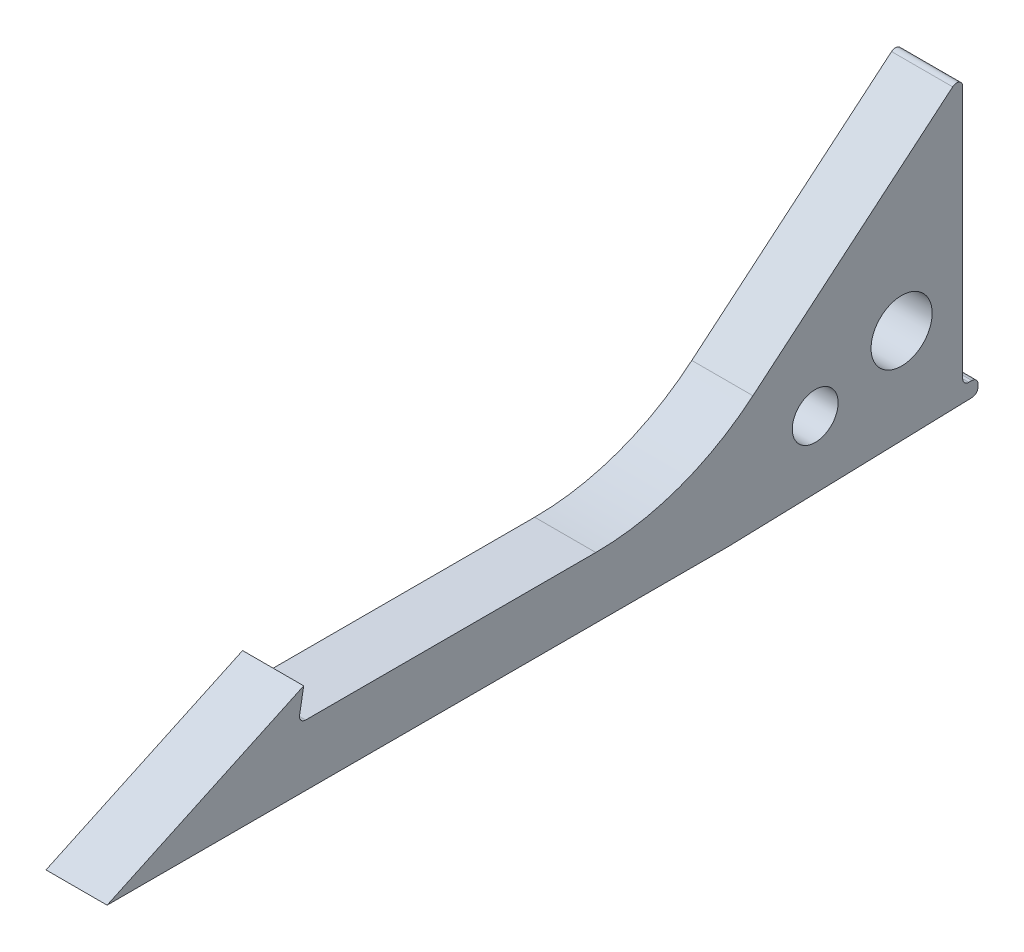
ISO-10303-21;
HEADER;
FILE_DESCRIPTION(('STEP AP214'),'2;1');
FILE_NAME('part.step','',(''),(''),'','','');
FILE_SCHEMA(('AUTOMOTIVE_DESIGN { 1 0 10303 214 1 1 1 1 }'));
ENDSEC;
DATA;
#1=APPLICATION_CONTEXT('core data for automotive mechanical design processes');
#2=APPLICATION_PROTOCOL_DEFINITION('international standard','automotive_design',2000,#1);
#3=PRODUCT_CONTEXT('',#1,'mechanical');
#4=PRODUCT('Part','Part','',(#3));
#5=PRODUCT_RELATED_PRODUCT_CATEGORY('part','',(#4));
#6=PRODUCT_DEFINITION_FORMATION('','',#4);
#7=PRODUCT_DEFINITION_CONTEXT('part definition',#1,'design');
#8=PRODUCT_DEFINITION('design','',#6,#7);
#9=PRODUCT_DEFINITION_SHAPE('','',#8);
#10=(LENGTH_UNIT() NAMED_UNIT(*) SI_UNIT(.MILLI.,.METRE.));
#11=(NAMED_UNIT(*) PLANE_ANGLE_UNIT() SI_UNIT($,.RADIAN.));
#12=(NAMED_UNIT(*) SI_UNIT($,.STERADIAN.) SOLID_ANGLE_UNIT());
#13=UNCERTAINTY_MEASURE_WITH_UNIT(LENGTH_MEASURE(1.E-05),#10,'distance_accuracy_value','');
#14=(GEOMETRIC_REPRESENTATION_CONTEXT(3) GLOBAL_UNCERTAINTY_ASSIGNED_CONTEXT((#13)) GLOBAL_UNIT_ASSIGNED_CONTEXT((#10,
#11,#12)) REPRESENTATION_CONTEXT('',''));
#15=CARTESIAN_POINT('',(0.,0.,0.));
#16=DIRECTION('',(0.,0.,1.));
#17=DIRECTION('',(1.,0.,0.));
#18=AXIS2_PLACEMENT_3D('',#15,#16,#17);
#19=CARTESIAN_POINT('',(41.275,0.,0.));
#20=DIRECTION('',(-1.,0.,0.));
#21=DIRECTION('',(0.,0.,1.));
#22=AXIS2_PLACEMENT_3D('',#19,#20,#21);
#23=PLANE('',#22);
#24=DIRECTION('',(0.,0.,-1.));
#25=VECTOR('',#24,1.);
#26=CARTESIAN_POINT('',(41.275,0.,128.82372));
#27=LINE('',#26,#25);
#28=CARTESIAN_POINT('',(41.275,0.,128.82372));
#29=VERTEX_POINT('',#28);
#30=CARTESIAN_POINT('',(41.275,0.,64.5726085720845));
#31=VERTEX_POINT('',#30);
#32=EDGE_CURVE('E152',#29,#31,#27,.T.);
#33=ORIENTED_EDGE('',*,*,#32,.T.);
#34=CARTESIAN_POINT('',(41.275,25.4,64.5726085720845));
#35=DIRECTION('',(-1.,0.,0.));
#36=DIRECTION('',(0.,0.,1.));
#37=AXIS2_PLACEMENT_3D('',#34,#35,#36);
#38=CIRCLE('',#37,25.4);
#39=CARTESIAN_POINT('',(41.275,0.0110178636845057,63.8245537065478));
#40=VERTEX_POINT('',#39);
#41=EDGE_CURVE('E237',#31,#40,#38,.F.);
#42=ORIENTED_EDGE('',*,*,#41,.T.);
#43=DIRECTION('',(0.,0.029450978958138,-0.999566225839192));
#44=VECTOR('',#43,1.);
#45=CARTESIAN_POINT('',(41.275,0.,64.1985000000002));
#46=LINE('',#45,#44);
#47=CARTESIAN_POINT('',(41.275,0.743841525387115,38.9525186283616));
#48=VERTEX_POINT('',#47);
#49=EDGE_CURVE('E162',#40,#48,#46,.T.);
#50=ORIENTED_EDGE('',*,*,#49,.T.);
#51=CARTESIAN_POINT('',(41.275,1.378566078795,38.97122));
#52=DIRECTION('',(-1.,0.,0.));
#53=DIRECTION('',(0.,0.,1.));
#54=AXIS2_PLACEMENT_3D('',#51,#52,#53);
#55=CIRCLE('',#54,0.635);
#56=CARTESIAN_POINT('',(41.275,1.378566078795,38.33622));
#57=VERTEX_POINT('',#56);
#58=EDGE_CURVE('E201',#48,#57,#55,.F.);
#59=ORIENTED_EDGE('',*,*,#58,.T.);
#60=DIRECTION('',(0.,1.,0.));
#61=VECTOR('',#60,1.);
#62=CARTESIAN_POINT('',(41.275,0.762000000000008,38.33622));
#63=LINE('',#62,#61);
#64=CARTESIAN_POINT('',(41.275,1.65100000000001,38.33622));
#65=VERTEX_POINT('',#64);
#66=EDGE_CURVE('E294',#57,#65,#63,.T.);
#67=ORIENTED_EDGE('',*,*,#66,.T.);
#68=CARTESIAN_POINT('',(41.275,1.65100000000001,38.97122));
#69=DIRECTION('',(-1.,0.,0.));
#70=DIRECTION('',(0.,0.,1.));
#71=AXIS2_PLACEMENT_3D('',#68,#69,#70);
#72=CIRCLE('',#71,0.635);
#73=CARTESIAN_POINT('',(41.275,2.28600000000001,38.97122));
#74=VERTEX_POINT('',#73);
#75=EDGE_CURVE('E199',#65,#74,#72,.F.);
#76=ORIENTED_EDGE('',*,*,#75,.T.);
#77=DIRECTION('',(0.,0.,1.));
#78=VECTOR('',#77,1.);
#79=CARTESIAN_POINT('',(41.275,2.28600000000001,38.33622));
#80=LINE('',#79,#78);
#81=CARTESIAN_POINT('',(41.275,2.28600000000001,39.28872));
#82=VERTEX_POINT('',#81);
#83=EDGE_CURVE('E297',#74,#82,#80,.T.);
#84=ORIENTED_EDGE('',*,*,#83,.T.);
#85=CARTESIAN_POINT('',(41.275,2.92100000000001,39.28872));
#86=DIRECTION('',(-1.,0.,0.));
#87=DIRECTION('',(0.,0.,1.));
#88=AXIS2_PLACEMENT_3D('',#85,#86,#87);
#89=CIRCLE('',#88,0.635);
#90=CARTESIAN_POINT('',(41.275,2.92100000000001,39.92372));
#91=VERTEX_POINT('',#90);
#92=EDGE_CURVE('E229',#82,#91,#89,.T.);
#93=ORIENTED_EDGE('',*,*,#92,.T.);
#94=DIRECTION('',(0.,1.,0.));
#95=VECTOR('',#94,1.);
#96=CARTESIAN_POINT('',(41.275,2.28600000000001,39.92372));
#97=LINE('',#96,#95);
#98=CARTESIAN_POINT('',(41.275,29.2220821357437,39.92372));
#99=VERTEX_POINT('',#98);
#100=EDGE_CURVE('E264',#91,#99,#97,.T.);
#101=ORIENTED_EDGE('',*,*,#100,.T.);
#102=CARTESIAN_POINT('',(41.275,29.2220821357437,40.55872));
#103=DIRECTION('',(-1.,0.,0.));
#104=DIRECTION('',(0.,0.,1.));
#105=AXIS2_PLACEMENT_3D('',#102,#103,#104);
#106=CIRCLE('',#105,0.635);
#107=CARTESIAN_POINT('',(41.275,29.7085203571243,40.9668901321509));
#108=VERTEX_POINT('',#107);
#109=EDGE_CURVE('E197',#99,#108,#106,.F.);
#110=ORIENTED_EDGE('',*,*,#109,.T.);
#111=DIRECTION('',(0.,-0.642787609686539,0.766044443118978));
#112=VECTOR('',#111,1.);
#113=CARTESIAN_POINT('',(41.275,30.5838440302673,39.92372));
#114=LINE('',#113,#112);
#115=CARTESIAN_POINT('',(41.275,12.2924711447779,61.7225293497622));
#116=VERTEX_POINT('',#115);
#117=EDGE_CURVE('E261',#108,#116,#114,.T.);
#118=ORIENTED_EDGE('',*,*,#117,.T.);
#119=CARTESIAN_POINT('',(41.275,31.75,78.0493346358003));
#120=DIRECTION('',(-1.,0.,0.));
#121=DIRECTION('',(0.,0.,1.));
#122=AXIS2_PLACEMENT_3D('',#119,#120,#121);
#123=CIRCLE('',#122,25.4);
#124=CARTESIAN_POINT('',(41.275,6.34999999999998,78.0493346358003));
#125=VERTEX_POINT('',#124);
#126=EDGE_CURVE('E11',#116,#125,#123,.T.);
#127=ORIENTED_EDGE('',*,*,#126,.T.);
#128=DIRECTION('',(0.,0.,1.));
#129=VECTOR('',#128,1.);
#130=CARTESIAN_POINT('',(41.275,6.34999999999998,68.8044906854388));
#131=LINE('',#130,#129);
#132=CARTESIAN_POINT('',(41.275,6.34999999999998,108.200366214598));
#133=VERTEX_POINT('',#132);
#134=EDGE_CURVE('E258',#125,#133,#131,.T.);
#135=ORIENTED_EDGE('',*,*,#134,.T.);
#136=CARTESIAN_POINT('',(41.275,6.98499999999998,108.200366214598));
#137=DIRECTION('',(-1.,0.,0.));
#138=DIRECTION('',(0.,0.,1.));
#139=AXIS2_PLACEMENT_3D('',#136,#137,#138);
#140=CIRCLE('',#139,0.635);
#141=CARTESIAN_POINT('',(41.275,7.09526659281849,108.825719137761));
#142=VERTEX_POINT('',#141);
#143=EDGE_CURVE('E225',#133,#142,#140,.T.);
#144=ORIENTED_EDGE('',*,*,#143,.T.);
#145=DIRECTION('',(0.,0.984807753012207,-0.173648177666936));
#146=VECTOR('',#145,1.);
#147=CARTESIAN_POINT('',(41.275,6.34999999999998,108.957129745895));
#148=LINE('',#147,#146);
#149=CARTESIAN_POINT('',(41.275,9.52499999999998,108.397291582146));
#150=VERTEX_POINT('',#149);
#151=EDGE_CURVE('E168',#142,#150,#148,.T.);
#152=ORIENTED_EDGE('',*,*,#151,.T.);
#153=DIRECTION('',(0.,-0.422618261740694,0.906307787036653));
#154=VECTOR('',#153,1.);
#155=CARTESIAN_POINT('',(41.275,9.52499999999998,108.397291582146));
#156=LINE('',#155,#154);
#157=EDGE_CURVE('E163',#150,#29,#156,.T.);
#158=ORIENTED_EDGE('',*,*,#157,.T.);
#159=EDGE_LOOP('',(#33,#42,#50,#59,#67,#76,#84,#93,#101,#110,#118,#127,#135,#144,#152,#158));
#160=FACE_BOUND('',#159,.T.);
#161=CARTESIAN_POINT('',(41.275,10.414,46.27372));
#162=DIRECTION('',(1.,0.,0.));
#163=DIRECTION('',(0.,0.,-1.));
#164=AXIS2_PLACEMENT_3D('',#161,#162,#163);
#165=CIRCLE('',#164,3.175);
#166=CARTESIAN_POINT('',(41.275,10.414,43.09872));
#167=VERTEX_POINT('',#166);
#168=EDGE_CURVE('E270',#167,#167,#165,.T.);
#169=ORIENTED_EDGE('',*,*,#168,.F.);
#170=EDGE_LOOP('',(#169));
#171=FACE_BOUND('',#170,.T.);
#172=CARTESIAN_POINT('',(41.275,7.23337589676642,55.2519857186079));
#173=DIRECTION('',(1.,0.,0.));
#174=DIRECTION('',(0.,0.,-1.));
#175=AXIS2_PLACEMENT_3D('',#172,#173,#174);
#176=CIRCLE('',#175,2.38125);
#177=CARTESIAN_POINT('',(41.275,7.23337589676642,52.8707357186079));
#178=VERTEX_POINT('',#177);
#179=EDGE_CURVE('E542',#178,#178,#176,.T.);
#180=ORIENTED_EDGE('',*,*,#179,.F.);
#181=EDGE_LOOP('',(#180));
#182=FACE_BOUND('',#181,.T.);
#183=ADVANCED_FACE('F39',(#160,#171,#182),#23,.F.);
#184=CARTESIAN_POINT('',(34.925,0.,0.));
#185=DIRECTION('',(-1.,0.,0.));
#186=DIRECTION('',(0.,0.,1.));
#187=AXIS2_PLACEMENT_3D('',#184,#185,#186);
#188=PLANE('',#187);
#189=CARTESIAN_POINT('',(34.925,10.414,46.27372));
#190=DIRECTION('',(1.,0.,0.));
#191=DIRECTION('',(0.,0.,-1.));
#192=AXIS2_PLACEMENT_3D('',#189,#190,#191);
#193=CIRCLE('',#192,3.175);
#194=CARTESIAN_POINT('',(34.925,10.414,43.09872));
#195=VERTEX_POINT('',#194);
#196=EDGE_CURVE('E541',#195,#195,#193,.T.);
#197=ORIENTED_EDGE('',*,*,#196,.T.);
#198=EDGE_LOOP('',(#197));
#199=FACE_BOUND('',#198,.T.);
#200=DIRECTION('',(0.,0.029450978958138,-0.999566225839192));
#201=VECTOR('',#200,1.);
#202=CARTESIAN_POINT('',(34.925,0.,64.1985000000002));
#203=LINE('',#202,#201);
#204=CARTESIAN_POINT('',(34.925,0.0110178636845057,63.8245537065478));
#205=VERTEX_POINT('',#204);
#206=CARTESIAN_POINT('',(34.925,0.743841525387115,38.9525186283616));
#207=VERTEX_POINT('',#206);
#208=EDGE_CURVE('E272',#205,#207,#203,.T.);
#209=ORIENTED_EDGE('',*,*,#208,.F.);
#210=CARTESIAN_POINT('',(34.925,25.4,64.5726085720845));
#211=DIRECTION('',(-1.,0.,0.));
#212=DIRECTION('',(0.,0.,1.));
#213=AXIS2_PLACEMENT_3D('',#210,#211,#212);
#214=CIRCLE('',#213,25.4);
#215=CARTESIAN_POINT('',(34.925,0.,64.5726085720845));
#216=VERTEX_POINT('',#215);
#217=EDGE_CURVE('E234',#205,#216,#214,.T.);
#218=ORIENTED_EDGE('',*,*,#217,.T.);
#219=DIRECTION('',(0.,0.,-1.));
#220=VECTOR('',#219,1.);
#221=CARTESIAN_POINT('',(34.925,0.,128.82372));
#222=LINE('',#221,#220);
#223=CARTESIAN_POINT('',(34.925,0.,128.82372));
#224=VERTEX_POINT('',#223);
#225=EDGE_CURVE('E269',#224,#216,#222,.T.);
#226=ORIENTED_EDGE('',*,*,#225,.F.);
#227=DIRECTION('',(0.,-0.422618261740694,0.906307787036653));
#228=VECTOR('',#227,1.);
#229=CARTESIAN_POINT('',(34.925,9.52499999999998,108.397291582146));
#230=LINE('',#229,#228);
#231=CARTESIAN_POINT('',(34.925,9.52499999999998,108.397291582146));
#232=VERTEX_POINT('',#231);
#233=EDGE_CURVE('E176',#232,#224,#230,.T.);
#234=ORIENTED_EDGE('',*,*,#233,.F.);
#235=DIRECTION('',(0.,0.984807753012207,-0.173648177666936));
#236=VECTOR('',#235,1.);
#237=CARTESIAN_POINT('',(34.925,6.34999999999998,108.957129745895));
#238=LINE('',#237,#236);
#239=CARTESIAN_POINT('',(34.925,7.09526659281849,108.825719137761));
#240=VERTEX_POINT('',#239);
#241=EDGE_CURVE('E172',#240,#232,#238,.T.);
#242=ORIENTED_EDGE('',*,*,#241,.F.);
#243=CARTESIAN_POINT('',(34.925,6.98499999999998,108.200366214598));
#244=DIRECTION('',(-1.,0.,0.));
#245=DIRECTION('',(0.,0.,1.));
#246=AXIS2_PLACEMENT_3D('',#243,#244,#245);
#247=CIRCLE('',#246,0.635);
#248=CARTESIAN_POINT('',(34.925,6.34999999999998,108.200366214598));
#249=VERTEX_POINT('',#248);
#250=EDGE_CURVE('E222',#240,#249,#247,.F.);
#251=ORIENTED_EDGE('',*,*,#250,.T.);
#252=DIRECTION('',(0.,0.,1.));
#253=VECTOR('',#252,1.);
#254=CARTESIAN_POINT('',(34.925,6.34999999999998,68.8044906854388));
#255=LINE('',#254,#253);
#256=CARTESIAN_POINT('',(34.925,6.34999999999998,78.0493346358003));
#257=VERTEX_POINT('',#256);
#258=EDGE_CURVE('E249',#257,#249,#255,.T.);
#259=ORIENTED_EDGE('',*,*,#258,.F.);
#260=CARTESIAN_POINT('',(34.925,31.75,78.0493346358003));
#261=DIRECTION('',(-1.,0.,0.));
#262=DIRECTION('',(0.,0.,1.));
#263=AXIS2_PLACEMENT_3D('',#260,#261,#262);
#264=CIRCLE('',#263,25.4);
#265=CARTESIAN_POINT('',(34.925,12.2924711447779,61.7225293497622));
#266=VERTEX_POINT('',#265);
#267=EDGE_CURVE('E47',#257,#266,#264,.F.);
#268=ORIENTED_EDGE('',*,*,#267,.T.);
#269=DIRECTION('',(0.,-0.642787609686539,0.766044443118978));
#270=VECTOR('',#269,1.);
#271=CARTESIAN_POINT('',(34.925,30.5838440302673,39.92372));
#272=LINE('',#271,#270);
#273=CARTESIAN_POINT('',(34.925,29.7085203571243,40.9668901321509));
#274=VERTEX_POINT('',#273);
#275=EDGE_CURVE('E248',#274,#266,#272,.T.);
#276=ORIENTED_EDGE('',*,*,#275,.F.);
#277=CARTESIAN_POINT('',(34.925,29.2220821357437,40.55872));
#278=DIRECTION('',(-1.,0.,0.));
#279=DIRECTION('',(0.,0.,1.));
#280=AXIS2_PLACEMENT_3D('',#277,#278,#279);
#281=CIRCLE('',#280,0.635);
#282=CARTESIAN_POINT('',(34.925,29.2220821357437,39.92372));
#283=VERTEX_POINT('',#282);
#284=EDGE_CURVE('E187',#274,#283,#281,.T.);
#285=ORIENTED_EDGE('',*,*,#284,.T.);
#286=DIRECTION('',(0.,1.,0.));
#287=VECTOR('',#286,1.);
#288=CARTESIAN_POINT('',(34.925,2.28600000000001,39.92372));
#289=LINE('',#288,#287);
#290=CARTESIAN_POINT('',(34.925,2.92100000000001,39.92372));
#291=VERTEX_POINT('',#290);
#292=EDGE_CURVE('E254',#291,#283,#289,.T.);
#293=ORIENTED_EDGE('',*,*,#292,.F.);
#294=CARTESIAN_POINT('',(34.925,2.92100000000001,39.28872));
#295=DIRECTION('',(-1.,0.,0.));
#296=DIRECTION('',(0.,0.,1.));
#297=AXIS2_PLACEMENT_3D('',#294,#295,#296);
#298=CIRCLE('',#297,0.635);
#299=CARTESIAN_POINT('',(34.925,2.28600000000001,39.28872));
#300=VERTEX_POINT('',#299);
#301=EDGE_CURVE('E227',#291,#300,#298,.F.);
#302=ORIENTED_EDGE('',*,*,#301,.T.);
#303=DIRECTION('',(0.,0.,1.));
#304=VECTOR('',#303,1.);
#305=CARTESIAN_POINT('',(34.925,2.28600000000001,38.33622));
#306=LINE('',#305,#304);
#307=CARTESIAN_POINT('',(34.925,2.28600000000001,38.97122));
#308=VERTEX_POINT('',#307);
#309=EDGE_CURVE('E277',#308,#300,#306,.T.);
#310=ORIENTED_EDGE('',*,*,#309,.F.);
#311=CARTESIAN_POINT('',(34.925,1.65100000000001,38.97122));
#312=DIRECTION('',(-1.,0.,0.));
#313=DIRECTION('',(0.,0.,1.));
#314=AXIS2_PLACEMENT_3D('',#311,#312,#313);
#315=CIRCLE('',#314,0.635);
#316=CARTESIAN_POINT('',(34.925,1.65100000000001,38.33622));
#317=VERTEX_POINT('',#316);
#318=EDGE_CURVE('E189',#308,#317,#315,.T.);
#319=ORIENTED_EDGE('',*,*,#318,.T.);
#320=DIRECTION('',(0.,1.,0.));
#321=VECTOR('',#320,1.);
#322=CARTESIAN_POINT('',(34.925,0.762000000000008,38.33622));
#323=LINE('',#322,#321);
#324=CARTESIAN_POINT('',(34.925,1.378566078795,38.33622));
#325=VERTEX_POINT('',#324);
#326=EDGE_CURVE('E274',#325,#317,#323,.T.);
#327=ORIENTED_EDGE('',*,*,#326,.F.);
#328=CARTESIAN_POINT('',(34.925,1.378566078795,38.97122));
#329=DIRECTION('',(-1.,0.,0.));
#330=DIRECTION('',(0.,0.,1.));
#331=AXIS2_PLACEMENT_3D('',#328,#329,#330);
#332=CIRCLE('',#331,0.635);
#333=EDGE_CURVE('E191',#325,#207,#332,.T.);
#334=ORIENTED_EDGE('',*,*,#333,.T.);
#335=EDGE_LOOP('',(#209,#218,#226,#234,#242,#251,#259,#268,#276,#285,#293,#302,#310,#319,#327,#334));
#336=FACE_BOUND('',#335,.T.);
#337=CARTESIAN_POINT('',(34.925,7.23337589676642,55.2519857186079));
#338=DIRECTION('',(1.,0.,0.));
#339=DIRECTION('',(0.,0.,-1.));
#340=AXIS2_PLACEMENT_3D('',#337,#338,#339);
#341=CIRCLE('',#340,2.38125);
#342=CARTESIAN_POINT('',(34.925,7.23337589676642,52.8707357186079));
#343=VERTEX_POINT('',#342);
#344=EDGE_CURVE('E546',#343,#343,#341,.T.);
#345=ORIENTED_EDGE('',*,*,#344,.T.);
#346=EDGE_LOOP('',(#345));
#347=FACE_BOUND('',#346,.T.);
#348=ADVANCED_FACE('F246',(#199,#336,#347),#188,.T.);
#349=CARTESIAN_POINT('',(41.275,9.52499999999998,108.397291582146));
#350=DIRECTION('',(0.,-0.906307787036653,-0.422618261740694));
#351=DIRECTION('',(0.,0.422618261740694,-0.906307787036653));
#352=AXIS2_PLACEMENT_3D('',#349,#350,#351);
#353=PLANE('',#352);
#354=ORIENTED_EDGE('',*,*,#233,.T.);
#355=DIRECTION('',(-1.,0.,0.));
#356=VECTOR('',#355,1.);
#357=CARTESIAN_POINT('',(41.275,0.,128.82372));
#358=LINE('',#357,#356);
#359=EDGE_CURVE('E157',#29,#224,#358,.T.);
#360=ORIENTED_EDGE('',*,*,#359,.F.);
#361=ORIENTED_EDGE('',*,*,#157,.F.);
#362=DIRECTION('',(-1.,0.,0.));
#363=VECTOR('',#362,1.);
#364=CARTESIAN_POINT('',(41.275,9.52499999999998,108.397291582146));
#365=LINE('',#364,#363);
#366=EDGE_CURVE('E178',#150,#232,#365,.T.);
#367=ORIENTED_EDGE('',*,*,#366,.T.);
#368=EDGE_LOOP('',(#354,#360,#361,#367));
#369=FACE_BOUND('',#368,.T.);
#370=ADVANCED_FACE('F174',(#369),#353,.F.);
#371=CARTESIAN_POINT('',(41.275,0.,128.82372));
#372=DIRECTION('',(0.,1.,0.));
#373=DIRECTION('',(0.,0.,1.));
#374=AXIS2_PLACEMENT_3D('',#371,#372,#373);
#375=PLANE('',#374);
#376=ORIENTED_EDGE('',*,*,#225,.T.);
#377=DIRECTION('',(-1.,0.,0.));
#378=VECTOR('',#377,1.);
#379=CARTESIAN_POINT('',(41.275,0.,64.5726085720845));
#380=LINE('',#379,#378);
#381=EDGE_CURVE('E160',#216,#31,#380,.F.);
#382=ORIENTED_EDGE('',*,*,#381,.T.);
#383=ORIENTED_EDGE('',*,*,#32,.F.);
#384=ORIENTED_EDGE('',*,*,#359,.T.);
#385=EDGE_LOOP('',(#376,#382,#383,#384));
#386=FACE_BOUND('',#385,.T.);
#387=ADVANCED_FACE('F155',(#386),#375,.F.);
#388=CARTESIAN_POINT('',(41.275,0.,64.1985000000002));
#389=DIRECTION('',(0.,0.999566225839192,0.029450978958138));
#390=DIRECTION('',(0.,-0.029450978958138,0.999566225839193));
#391=AXIS2_PLACEMENT_3D('',#388,#389,#390);
#392=PLANE('',#391);
#393=ORIENTED_EDGE('',*,*,#49,.F.);
#394=DIRECTION('',(-1.,0.,0.));
#395=VECTOR('',#394,1.);
#396=CARTESIAN_POINT('',(41.275,0.0110178636845057,63.8245537065478));
#397=LINE('',#396,#395);
#398=EDGE_CURVE('E231',#40,#205,#397,.T.);
#399=ORIENTED_EDGE('',*,*,#398,.T.);
#400=ORIENTED_EDGE('',*,*,#208,.T.);
#401=DIRECTION('',(-1.,0.,0.));
#402=VECTOR('',#401,1.);
#403=CARTESIAN_POINT('',(41.275,0.743841525387115,38.9525186283615));
#404=LINE('',#403,#402);
#405=EDGE_CURVE('E194',#207,#48,#404,.F.);
#406=ORIENTED_EDGE('',*,*,#405,.T.);
#407=EDGE_LOOP('',(#393,#399,#400,#406));
#408=FACE_BOUND('',#407,.T.);
#409=ADVANCED_FACE('F291',(#408),#392,.F.);
#410=CARTESIAN_POINT('',(41.275,0.762000000000008,38.33622));
#411=DIRECTION('',(0.,0.,1.));
#412=DIRECTION('',(1.,0.,0.));
#413=AXIS2_PLACEMENT_3D('',#410,#411,#412);
#414=PLANE('',#413);
#415=ORIENTED_EDGE('',*,*,#66,.F.);
#416=DIRECTION('',(-1.,0.,0.));
#417=VECTOR('',#416,1.);
#418=CARTESIAN_POINT('',(41.275,1.378566078795,38.33622));
#419=LINE('',#418,#417);
#420=EDGE_CURVE('E180',#57,#325,#419,.T.);
#421=ORIENTED_EDGE('',*,*,#420,.T.);
#422=ORIENTED_EDGE('',*,*,#326,.T.);
#423=DIRECTION('',(-1.,0.,0.));
#424=VECTOR('',#423,1.);
#425=CARTESIAN_POINT('',(41.275,1.65100000000001,38.33622));
#426=LINE('',#425,#424);
#427=EDGE_CURVE('E177',#317,#65,#426,.F.);
#428=ORIENTED_EDGE('',*,*,#427,.T.);
#429=EDGE_LOOP('',(#415,#421,#422,#428));
#430=FACE_BOUND('',#429,.T.);
#431=ADVANCED_FACE('F327',(#430),#414,.F.);
#432=CARTESIAN_POINT('',(41.275,2.28600000000001,38.33622));
#433=DIRECTION('',(0.,-1.,0.));
#434=DIRECTION('',(0.,0.,-1.));
#435=AXIS2_PLACEMENT_3D('',#432,#433,#434);
#436=PLANE('',#435);
#437=ORIENTED_EDGE('',*,*,#83,.F.);
#438=DIRECTION('',(-1.,0.,0.));
#439=VECTOR('',#438,1.);
#440=CARTESIAN_POINT('',(41.275,2.28600000000001,38.97122));
#441=LINE('',#440,#439);
#442=EDGE_CURVE('E205',#74,#308,#441,.T.);
#443=ORIENTED_EDGE('',*,*,#442,.T.);
#444=ORIENTED_EDGE('',*,*,#309,.T.);
#445=DIRECTION('',(-1.,0.,0.));
#446=VECTOR('',#445,1.);
#447=CARTESIAN_POINT('',(41.275,2.28600000000001,39.28872));
#448=LINE('',#447,#446);
#449=EDGE_CURVE('E203',#300,#82,#448,.F.);
#450=ORIENTED_EDGE('',*,*,#449,.T.);
#451=EDGE_LOOP('',(#437,#443,#444,#450));
#452=FACE_BOUND('',#451,.T.);
#453=ADVANCED_FACE('F318',(#452),#436,.F.);
#454=CARTESIAN_POINT('',(41.275,2.28600000000001,39.92372));
#455=DIRECTION('',(0.,0.,1.));
#456=DIRECTION('',(1.,0.,0.));
#457=AXIS2_PLACEMENT_3D('',#454,#455,#456);
#458=PLANE('',#457);
#459=ORIENTED_EDGE('',*,*,#292,.T.);
#460=DIRECTION('',(-1.,0.,0.));
#461=VECTOR('',#460,1.);
#462=CARTESIAN_POINT('',(41.275,29.2220821357437,39.92372));
#463=LINE('',#462,#461);
#464=EDGE_CURVE('E214',#283,#99,#463,.F.);
#465=ORIENTED_EDGE('',*,*,#464,.T.);
#466=ORIENTED_EDGE('',*,*,#100,.F.);
#467=DIRECTION('',(-1.,0.,0.));
#468=VECTOR('',#467,1.);
#469=CARTESIAN_POINT('',(34.925,2.92100000000001,39.92372));
#470=LINE('',#469,#468);
#471=EDGE_CURVE('E211',#91,#291,#470,.T.);
#472=ORIENTED_EDGE('',*,*,#471,.T.);
#473=EDGE_LOOP('',(#459,#465,#466,#472));
#474=FACE_BOUND('',#473,.T.);
#475=ADVANCED_FACE('F311',(#474),#458,.F.);
#476=CARTESIAN_POINT('',(41.275,30.5838440302673,39.92372));
#477=DIRECTION('',(0.,-0.766044443118978,-0.642787609686539));
#478=DIRECTION('',(0.,0.642787609686539,-0.766044443118978));
#479=AXIS2_PLACEMENT_3D('',#476,#477,#478);
#480=PLANE('',#479);
#481=ORIENTED_EDGE('',*,*,#275,.T.);
#482=DIRECTION('',(-1.,0.,0.));
#483=VECTOR('',#482,1.);
#484=CARTESIAN_POINT('',(41.275,12.292471144778,61.7225293497622));
#485=LINE('',#484,#483);
#486=EDGE_CURVE('E60',#266,#116,#485,.F.);
#487=ORIENTED_EDGE('',*,*,#486,.T.);
#488=ORIENTED_EDGE('',*,*,#117,.F.);
#489=DIRECTION('',(-1.,0.,0.));
#490=VECTOR('',#489,1.);
#491=CARTESIAN_POINT('',(41.275,29.7085203571243,40.9668901321509));
#492=LINE('',#491,#490);
#493=EDGE_CURVE('E208',#108,#274,#492,.T.);
#494=ORIENTED_EDGE('',*,*,#493,.T.);
#495=EDGE_LOOP('',(#481,#487,#488,#494));
#496=FACE_BOUND('',#495,.T.);
#497=ADVANCED_FACE('F252',(#496),#480,.F.);
#498=CARTESIAN_POINT('',(41.275,6.34999999999998,68.8044906854388));
#499=DIRECTION('',(0.,-1.,0.));
#500=DIRECTION('',(0.,0.,-1.));
#501=AXIS2_PLACEMENT_3D('',#498,#499,#500);
#502=PLANE('',#501);
#503=ORIENTED_EDGE('',*,*,#134,.F.);
#504=DIRECTION('',(-1.,0.,0.));
#505=VECTOR('',#504,1.);
#506=CARTESIAN_POINT('',(34.925,6.34999999999998,78.0493346358003));
#507=LINE('',#506,#505);
#508=EDGE_CURVE('E239',#125,#257,#507,.T.);
#509=ORIENTED_EDGE('',*,*,#508,.T.);
#510=ORIENTED_EDGE('',*,*,#258,.T.);
#511=DIRECTION('',(-1.,0.,0.));
#512=VECTOR('',#511,1.);
#513=CARTESIAN_POINT('',(41.275,6.34999999999998,108.200366214598));
#514=LINE('',#513,#512);
#515=EDGE_CURVE('E219',#249,#133,#514,.F.);
#516=ORIENTED_EDGE('',*,*,#515,.T.);
#517=EDGE_LOOP('',(#503,#509,#510,#516));
#518=FACE_BOUND('',#517,.T.);
#519=ADVANCED_FACE('F257',(#518),#502,.F.);
#520=CARTESIAN_POINT('',(41.275,6.34999999999998,108.957129745895));
#521=DIRECTION('',(0.,0.173648177666936,0.984807753012207));
#522=DIRECTION('',(0.,-0.984807753012207,0.173648177666936));
#523=AXIS2_PLACEMENT_3D('',#520,#521,#522);
#524=PLANE('',#523);
#525=ORIENTED_EDGE('',*,*,#151,.F.);
#526=DIRECTION('',(-1.,0.,0.));
#527=VECTOR('',#526,1.);
#528=CARTESIAN_POINT('',(34.925,7.09526659281849,108.825719137761));
#529=LINE('',#528,#527);
#530=EDGE_CURVE('E216',#142,#240,#529,.T.);
#531=ORIENTED_EDGE('',*,*,#530,.T.);
#532=ORIENTED_EDGE('',*,*,#241,.T.);
#533=ORIENTED_EDGE('',*,*,#366,.F.);
#534=EDGE_LOOP('',(#525,#531,#532,#533));
#535=FACE_BOUND('',#534,.T.);
#536=ADVANCED_FACE('F284',(#535),#524,.F.);
#537=CARTESIAN_POINT('',(41.275,10.414,46.27372));
#538=DIRECTION('',(-1.,0.,0.));
#539=DIRECTION('',(0.,0.,1.));
#540=AXIS2_PLACEMENT_3D('',#537,#538,#539);
#541=CYLINDRICAL_SURFACE('',#540,3.175);
#542=ORIENTED_EDGE('',*,*,#168,.T.);
#543=EDGE_LOOP('',(#542));
#544=FACE_BOUND('',#543,.T.);
#545=ORIENTED_EDGE('',*,*,#196,.F.);
#546=EDGE_LOOP('',(#545));
#547=FACE_BOUND('',#546,.T.);
#548=ADVANCED_FACE('F339',(#544,#547),#541,.F.);
#549=CARTESIAN_POINT('',(41.275,7.23337589676642,55.2519857186079));
#550=DIRECTION('',(-1.,0.,0.));
#551=DIRECTION('',(0.,0.,1.));
#552=AXIS2_PLACEMENT_3D('',#549,#550,#551);
#553=CYLINDRICAL_SURFACE('',#552,2.38125);
#554=ORIENTED_EDGE('',*,*,#179,.T.);
#555=EDGE_LOOP('',(#554));
#556=FACE_BOUND('',#555,.T.);
#557=ORIENTED_EDGE('',*,*,#344,.F.);
#558=EDGE_LOOP('',(#557));
#559=FACE_BOUND('',#558,.T.);
#560=ADVANCED_FACE('F332',(#556,#559),#553,.F.);
#561=CARTESIAN_POINT('',(41.275,1.378566078795,38.97122));
#562=DIRECTION('',(-1.,0.,0.));
#563=DIRECTION('',(0.,0.,1.));
#564=AXIS2_PLACEMENT_3D('',#561,#562,#563);
#565=CYLINDRICAL_SURFACE('',#564,0.635);
#566=ORIENTED_EDGE('',*,*,#58,.F.);
#567=ORIENTED_EDGE('',*,*,#405,.F.);
#568=ORIENTED_EDGE('',*,*,#333,.F.);
#569=ORIENTED_EDGE('',*,*,#420,.F.);
#570=EDGE_LOOP('',(#566,#567,#568,#569));
#571=FACE_BOUND('',#570,.T.);
#572=ADVANCED_FACE('F330',(#571),#565,.T.);
#573=CARTESIAN_POINT('',(41.275,1.65100000000001,38.97122));
#574=DIRECTION('',(-1.,0.,0.));
#575=DIRECTION('',(0.,0.,1.));
#576=AXIS2_PLACEMENT_3D('',#573,#574,#575);
#577=CYLINDRICAL_SURFACE('',#576,0.635);
#578=ORIENTED_EDGE('',*,*,#75,.F.);
#579=ORIENTED_EDGE('',*,*,#427,.F.);
#580=ORIENTED_EDGE('',*,*,#318,.F.);
#581=ORIENTED_EDGE('',*,*,#442,.F.);
#582=EDGE_LOOP('',(#578,#579,#580,#581));
#583=FACE_BOUND('',#582,.T.);
#584=ADVANCED_FACE('F322',(#583),#577,.T.);
#585=CARTESIAN_POINT('',(41.275,29.2220821357437,40.55872));
#586=DIRECTION('',(-1.,0.,0.));
#587=DIRECTION('',(0.,0.,1.));
#588=AXIS2_PLACEMENT_3D('',#585,#586,#587);
#589=CYLINDRICAL_SURFACE('',#588,0.635);
#590=ORIENTED_EDGE('',*,*,#109,.F.);
#591=ORIENTED_EDGE('',*,*,#464,.F.);
#592=ORIENTED_EDGE('',*,*,#284,.F.);
#593=ORIENTED_EDGE('',*,*,#493,.F.);
#594=EDGE_LOOP('',(#590,#591,#592,#593));
#595=FACE_BOUND('',#594,.T.);
#596=ADVANCED_FACE('F309',(#595),#589,.T.);
#597=CARTESIAN_POINT('',(41.275,6.98499999999998,108.200366214598));
#598=DIRECTION('',(1.,0.,0.));
#599=DIRECTION('',(0.,0.,-1.));
#600=AXIS2_PLACEMENT_3D('',#597,#598,#599);
#601=CYLINDRICAL_SURFACE('',#600,0.635);
#602=ORIENTED_EDGE('',*,*,#143,.F.);
#603=ORIENTED_EDGE('',*,*,#515,.F.);
#604=ORIENTED_EDGE('',*,*,#250,.F.);
#605=ORIENTED_EDGE('',*,*,#530,.F.);
#606=EDGE_LOOP('',(#602,#603,#604,#605));
#607=FACE_BOUND('',#606,.T.);
#608=ADVANCED_FACE('F443',(#607),#601,.F.);
#609=CARTESIAN_POINT('',(41.275,2.92100000000001,39.28872));
#610=DIRECTION('',(1.,0.,0.));
#611=DIRECTION('',(0.,0.,-1.));
#612=AXIS2_PLACEMENT_3D('',#609,#610,#611);
#613=CYLINDRICAL_SURFACE('',#612,0.635);
#614=ORIENTED_EDGE('',*,*,#92,.F.);
#615=ORIENTED_EDGE('',*,*,#449,.F.);
#616=ORIENTED_EDGE('',*,*,#301,.F.);
#617=ORIENTED_EDGE('',*,*,#471,.F.);
#618=EDGE_LOOP('',(#614,#615,#616,#617));
#619=FACE_BOUND('',#618,.T.);
#620=ADVANCED_FACE('F313',(#619),#613,.F.);
#621=CARTESIAN_POINT('',(41.275,25.4,64.5726085720845));
#622=DIRECTION('',(-1.,0.,0.));
#623=DIRECTION('',(0.,0.,1.));
#624=AXIS2_PLACEMENT_3D('',#621,#622,#623);
#625=CYLINDRICAL_SURFACE('',#624,25.4);
#626=ORIENTED_EDGE('',*,*,#41,.F.);
#627=ORIENTED_EDGE('',*,*,#381,.F.);
#628=ORIENTED_EDGE('',*,*,#217,.F.);
#629=ORIENTED_EDGE('',*,*,#398,.F.);
#630=EDGE_LOOP('',(#626,#627,#628,#629));
#631=FACE_BOUND('',#630,.T.);
#632=ADVANCED_FACE('F287',(#631),#625,.T.);
#633=CARTESIAN_POINT('',(41.275,31.75,78.0493346358003));
#634=DIRECTION('',(1.,0.,0.));
#635=DIRECTION('',(0.,0.,-1.));
#636=AXIS2_PLACEMENT_3D('',#633,#634,#635);
#637=CYLINDRICAL_SURFACE('',#636,25.4);
#638=ORIENTED_EDGE('',*,*,#126,.F.);
#639=ORIENTED_EDGE('',*,*,#486,.F.);
#640=ORIENTED_EDGE('',*,*,#267,.F.);
#641=ORIENTED_EDGE('',*,*,#508,.F.);
#642=EDGE_LOOP('',(#638,#639,#640,#641));
#643=FACE_BOUND('',#642,.T.);
#644=ADVANCED_FACE('F41',(#643),#637,.F.);
#645=CLOSED_SHELL('',(#183,#348,#370,#387,#409,#431,#453,#475,#497,#519,#536,#548,#560,#572,
#584,#596,#608,#620,#632,#644));
#646=MANIFOLD_SOLID_BREP('B2',#645);
#647=ADVANCED_BREP_SHAPE_REPRESENTATION('',(#18,#646),#14);
#648=SHAPE_DEFINITION_REPRESENTATION(#9,#647);
ENDSEC;
END-ISO-10303-21;
